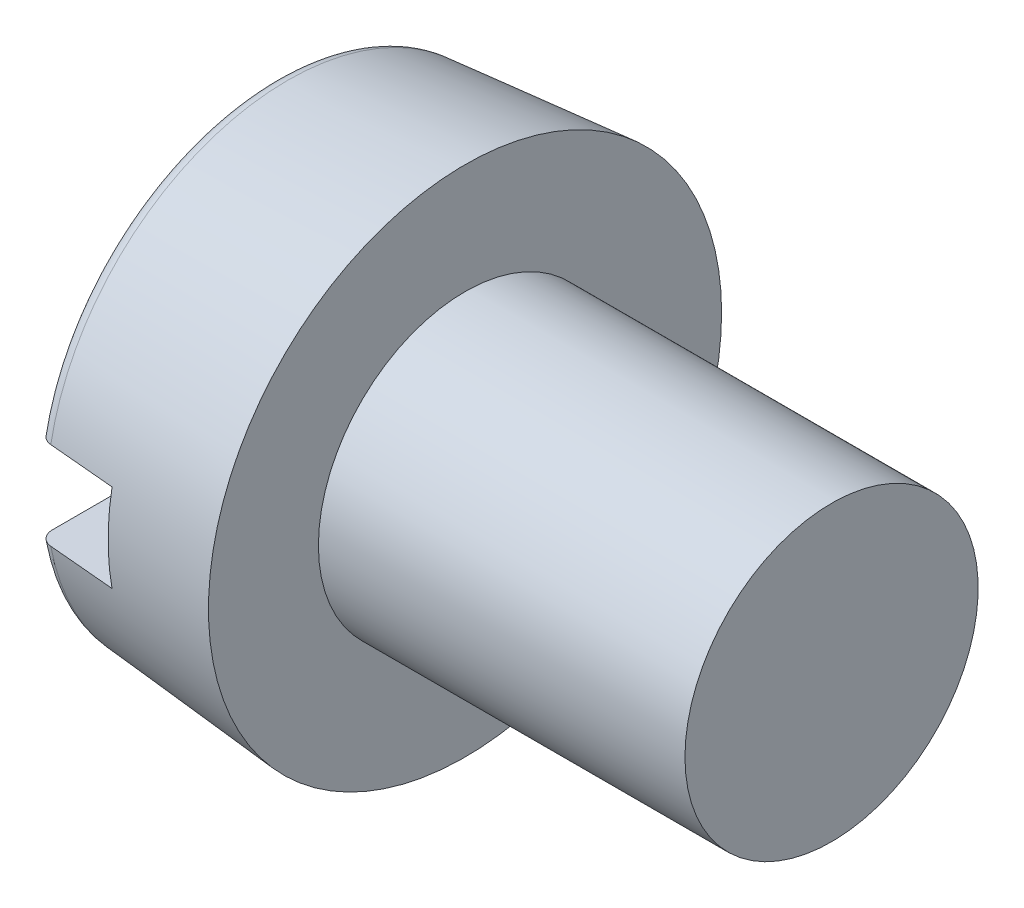
ISO-10303-21;
HEADER;
FILE_DESCRIPTION(('STEP AP214'),'2;1');
FILE_NAME('part.step','',(''),(''),'','','');
FILE_SCHEMA(('AUTOMOTIVE_DESIGN { 1 0 10303 214 1 1 1 1 }'));
ENDSEC;
DATA;
#1=APPLICATION_CONTEXT('core data for automotive mechanical design processes');
#2=APPLICATION_PROTOCOL_DEFINITION('international standard','automotive_design',2000,#1);
#3=PRODUCT_CONTEXT('',#1,'mechanical');
#4=PRODUCT('Part','Part','',(#3));
#5=PRODUCT_RELATED_PRODUCT_CATEGORY('part','',(#4));
#6=PRODUCT_DEFINITION_FORMATION('','',#4);
#7=PRODUCT_DEFINITION_CONTEXT('part definition',#1,'design');
#8=PRODUCT_DEFINITION('design','',#6,#7);
#9=PRODUCT_DEFINITION_SHAPE('','',#8);
#10=(LENGTH_UNIT() NAMED_UNIT(*) SI_UNIT(.MILLI.,.METRE.));
#11=(NAMED_UNIT(*) PLANE_ANGLE_UNIT() SI_UNIT($,.RADIAN.));
#12=(NAMED_UNIT(*) SI_UNIT($,.STERADIAN.) SOLID_ANGLE_UNIT());
#13=UNCERTAINTY_MEASURE_WITH_UNIT(LENGTH_MEASURE(1.E-05),#10,'distance_accuracy_value','');
#14=(GEOMETRIC_REPRESENTATION_CONTEXT(3) GLOBAL_UNCERTAINTY_ASSIGNED_CONTEXT((#13)) GLOBAL_UNIT_ASSIGNED_CONTEXT((#10,
#11,#12)) REPRESENTATION_CONTEXT('',''));
#15=CARTESIAN_POINT('',(0.,0.,0.));
#16=DIRECTION('',(0.,0.,1.));
#17=DIRECTION('',(1.,0.,0.));
#18=AXIS2_PLACEMENT_3D('',#15,#16,#17);
#19=CARTESIAN_POINT('',(1.1,0.6,-3.5));
#20=DIRECTION('',(-1.,0.,0.));
#21=DIRECTION('',(0.,0.,1.));
#22=AXIS2_PLACEMENT_3D('',#19,#20,#21);
#23=PLANE('',#22);
#24=DIRECTION('',(0.,0.,1.));
#25=VECTOR('',#24,1.);
#26=CARTESIAN_POINT('',(1.1,0.6,3.5));
#27=LINE('',#26,#25);
#28=CARTESIAN_POINT('',(1.10000000000466,0.6,3.31490439259874));
#29=VERTEX_POINT('',#28);
#30=CARTESIAN_POINT('',(1.10000000000405,0.6,-3.31490439259868));
#31=VERTEX_POINT('',#30);
#32=EDGE_CURVE('E79',#29,#31,#27,.F.);
#33=ORIENTED_EDGE('',*,*,#32,.T.);
#34=CARTESIAN_POINT('',(1.10000000000809,0.,0.));
#35=DIRECTION('',(1.,0.,0.));
#36=DIRECTION('',(0.,0.,-1.));
#37=AXIS2_PLACEMENT_3D('',#34,#35,#36);
#38=CIRCLE('',#37,3.36876700471737);
#39=CARTESIAN_POINT('',(1.10000000000468,-0.6,-3.31490439259874));
#40=VERTEX_POINT('',#39);
#41=EDGE_CURVE('E89',#31,#40,#38,.F.);
#42=ORIENTED_EDGE('',*,*,#41,.T.);
#43=DIRECTION('',(0.,0.,-1.));
#44=VECTOR('',#43,1.);
#45=CARTESIAN_POINT('',(1.1,-0.6,-3.5));
#46=LINE('',#45,#44);
#47=CARTESIAN_POINT('',(1.10000000000405,-0.600000000000001,3.31490439259868));
#48=VERTEX_POINT('',#47);
#49=EDGE_CURVE('E86',#40,#48,#46,.F.);
#50=ORIENTED_EDGE('',*,*,#49,.T.);
#51=CARTESIAN_POINT('',(1.10000000000809,0.,0.));
#52=DIRECTION('',(1.,0.,0.));
#53=DIRECTION('',(0.,0.,-1.));
#54=AXIS2_PLACEMENT_3D('',#51,#52,#53);
#55=CIRCLE('',#54,3.36876700471737);
#56=EDGE_CURVE('E19',#48,#29,#55,.F.);
#57=ORIENTED_EDGE('',*,*,#56,.T.);
#58=EDGE_LOOP('',(#33,#42,#50,#57));
#59=FACE_BOUND('',#58,.T.);
#60=ADVANCED_FACE('F16',(#59),#23,.T.);
#61=CARTESIAN_POINT('',(1.1,0.6,3.5));
#62=DIRECTION('',(0.,1.,0.));
#63=DIRECTION('',(0.,0.,1.));
#64=AXIS2_PLACEMENT_3D('',#61,#62,#63);
#65=PLANE('',#64);
#66=ORIENTED_EDGE('',*,*,#32,.F.);
#67=CARTESIAN_POINT('',(0.182568851454256,0.6,3.23330273645809));
#68=CARTESIAN_POINT('',(0.335473556850061,0.6,3.24690847681179));
#69=CARTESIAN_POINT('',(0.488378505260504,0.6,3.26051148500036));
#70=CARTESIAN_POINT('',(0.794188888109491,0.6,3.28771203704714));
#71=CARTESIAN_POINT('',(0.947094322548035,0.6,3.30130958090535));
#72=CARTESIAN_POINT('',(1.10000000000122,0.6,3.31490439259843));
#73=B_SPLINE_CURVE_WITH_KNOTS('',3,(#67,#68,#69,#70,#71,#72),.UNSPECIFIED.,.F.,.F.,(4,2,4),(0.,
0.460526530963861,0.921053061924176),.UNSPECIFIED.);
#74=CARTESIAN_POINT('',(0.182568851463089,0.6,3.23330273645694));
#75=VERTEX_POINT('',#74);
#76=EDGE_CURVE('E69',#75,#29,#73,.T.);
#77=ORIENTED_EDGE('',*,*,#76,.F.);
#78=CARTESIAN_POINT('',(0.,0.599999999999999,3.03043682761994));
#79=CARTESIAN_POINT('',(-8.92276711938872E-06,0.600000000000926,3.04205210805298));
#80=CARTESIAN_POINT('',(0.000973204864241999,0.600000000000543,3.05366618875901));
#81=CARTESIAN_POINT('',(0.0048583823746391,0.599999999999457,3.07656708233098));
#82=CARTESIAN_POINT('',(0.00776118005155454,0.599999999998755,3.08785393796157));
#83=CARTESIAN_POINT('',(0.0154293297762819,0.599999999999335,3.10978668687681));
#84=CARTESIAN_POINT('',(0.0201960317635953,0.600000000000619,3.12043210913728));
#85=CARTESIAN_POINT('',(0.0314639130665996,0.59999999999938,3.14075672068877));
#86=CARTESIAN_POINT('',(0.0379643576695787,0.599999999996858,3.15043631688841));
#87=CARTESIAN_POINT('',(0.0524560587306095,0.599999999997462,3.16845455019423));
#88=CARTESIAN_POINT('',(0.0604324501561322,0.600000000000534,3.17680513564901));
#89=CARTESIAN_POINT('',(0.0776955342490941,0.599999999999465,3.19201902933438));
#90=CARTESIAN_POINT('',(0.0869820289644172,0.599999999995325,3.19888256185703));
#91=CARTESIAN_POINT('',(0.106435856679454,0.599999999995523,3.21080710889614));
#92=CARTESIAN_POINT('',(0.116586055155842,0.599999999999723,3.2158960924536));
#93=CARTESIAN_POINT('',(0.137592975718863,0.600000000000275,3.22425888492082));
#94=CARTESIAN_POINT('',(0.148448535761883,0.59999999999664,3.22753559876399));
#95=CARTESIAN_POINT('',(0.167114441065982,0.599999999995137,3.23146563373131));
#96=CARTESIAN_POINT('',(0.174822526263816,0.599999999995827,3.23261780195108));
#97=CARTESIAN_POINT('',(0.18256885145479,0.6,3.23330273645209));
#98=B_SPLINE_CURVE_WITH_KNOTS('',3,(#78,#79,#80,#81,#82,#83,#84,#85,#86,#87,#88,#89,#90,#91,#92,
#93,#94,#95,#96,#97),.UNSPECIFIED.,.F.,.F.,(4,2,2,2,2,2,2,2,2,4),(0.,0.0348029281865724,
0.0696012873265984,0.104424896125296,0.139233771014052,0.173709468497491,0.208179962389296,
0.242079590894619,0.275924722159496,0.299249852575361),.UNSPECIFIED.);
#99=CARTESIAN_POINT('',(0.,0.6,3.03043682761994));
#100=VERTEX_POINT('',#99);
#101=EDGE_CURVE('E80',#100,#75,#98,.T.);
#102=ORIENTED_EDGE('',*,*,#101,.F.);
#103=DIRECTION('',(0.,0.,1.));
#104=VECTOR('',#103,1.);
#105=CARTESIAN_POINT('',(0.,0.6,0.));
#106=LINE('',#105,#104);
#107=CARTESIAN_POINT('',(0.,0.6,-3.03043682761994));
#108=VERTEX_POINT('',#107);
#109=EDGE_CURVE('E119',#108,#100,#106,.T.);
#110=ORIENTED_EDGE('',*,*,#109,.F.);
#111=CARTESIAN_POINT('',(0.182568851454788,0.599999999999999,-3.23330273645209));
#112=CARTESIAN_POINT('',(0.171472681594623,0.600000000000002,-3.23232565957753));
#113=CARTESIAN_POINT('',(0.160466490440903,0.600000000000001,-3.23038681875744));
#114=CARTESIAN_POINT('',(0.138948426592135,0.599999999999998,-3.22469378570043));
#115=CARTESIAN_POINT('',(0.128435940886201,0.599999999999996,-3.22094191371361));
#116=CARTESIAN_POINT('',(0.108187049490752,0.600000000000001,-3.21172671697903));
#117=CARTESIAN_POINT('',(0.0984508547008833,0.600000000000007,-3.20626292911875));
#118=CARTESIAN_POINT('',(0.0800245200002214,0.599999999999992,-3.193793084455));
#119=CARTESIAN_POINT('',(0.0713343007624212,0.59999999999997,-3.1867871447228));
#120=CARTESIAN_POINT('',(0.0551599248927894,0.600000000000032,-3.17137098416005));
#121=CARTESIAN_POINT('',(0.0476868506805745,0.600000000000117,-3.1629491407325));
#122=CARTESIAN_POINT('',(0.0342322998309484,0.599999999999882,-3.14498762109246));
#123=CARTESIAN_POINT('',(0.0282510437499762,0.599999999999561,-3.13544777989675));
#124=CARTESIAN_POINT('',(0.017840034395559,0.5999999999996,-3.11534500552784));
#125=CARTESIAN_POINT('',(0.0134390539697865,0.599999999999971,-3.10476717226775));
#126=CARTESIAN_POINT('',(0.00645122030947759,0.600000000000028,-3.08304101716856));
#127=CARTESIAN_POINT('',(0.00386248123053322,0.599999999999714,-3.07189330136284));
#128=CARTESIAN_POINT('',(0.000734376375379197,0.599999999999458,-3.05062255742231));
#129=CARTESIAN_POINT('',(-6.07384206114669E-06,0.599999999999478,-3.04052874119681));
#130=CARTESIAN_POINT('',(0.,0.599999999999999,-3.03043682761994));
#131=B_SPLINE_CURVE_WITH_KNOTS('',3,(#111,#112,#113,#114,#115,#116,#117,#118,#119,#120,#121,
#122,#123,#124,#125,#126,#127,#128,#129,#130),.UNSPECIFIED.,.F.,.F.,(4,2,2,2,2,2,2,2,2,4),(0.,
0.033369886991951,0.0666971810854079,0.100033498772122,0.133367286630274,0.166989405711503,
0.200616492680493,0.234828037616768,0.269003928393338,0.299257989197877),.UNSPECIFIED.);
#132=CARTESIAN_POINT('',(0.182568851462821,0.6,-3.23330273645994));
#133=VERTEX_POINT('',#132);
#134=EDGE_CURVE('E167',#133,#108,#131,.T.);
#135=ORIENTED_EDGE('',*,*,#134,.F.);
#136=CARTESIAN_POINT('',(1.10000000000126,0.6,-3.31490439259844));
#137=CARTESIAN_POINT('',(0.947094322548068,0.6,-3.30130958090535));
#138=CARTESIAN_POINT('',(0.794188888109517,0.6,-3.28771203704714));
#139=CARTESIAN_POINT('',(0.488378505260516,0.6,-3.26051148500036));
#140=CARTESIAN_POINT('',(0.335473556850066,0.6,-3.24690847681179));
#141=CARTESIAN_POINT('',(0.182568851454254,0.6,-3.23330273645809));
#142=B_SPLINE_CURVE_WITH_KNOTS('',3,(#136,#137,#138,#139,#140,#141),.UNSPECIFIED.,.F.,.F.,(4,2,
4),(0.,0.460526530960336,0.921053061924218),.UNSPECIFIED.);
#143=EDGE_CURVE('E92',#31,#133,#142,.T.);
#144=ORIENTED_EDGE('',*,*,#143,.F.);
#145=EDGE_LOOP('',(#66,#77,#102,#110,#135,#144));
#146=FACE_BOUND('',#145,.T.);
#147=ADVANCED_FACE('F90',(#146),#65,.F.);
#148=CARTESIAN_POINT('',(1.1,-0.6,-3.5));
#149=DIRECTION('',(0.,-1.,0.));
#150=DIRECTION('',(0.,0.,-1.));
#151=AXIS2_PLACEMENT_3D('',#148,#149,#150);
#152=PLANE('',#151);
#153=CARTESIAN_POINT('',(0.,-0.6,-3.03043682761993));
#154=CARTESIAN_POINT('',(-8.92276711936747E-06,-0.600000000000927,-3.04205210805298));
#155=CARTESIAN_POINT('',(0.000973204864241989,-0.600000000000543,-3.05366618875901));
#156=CARTESIAN_POINT('',(0.00485838237463901,-0.599999999999457,-3.07656708233098));
#157=CARTESIAN_POINT('',(0.00776118005155441,-0.599999999998754,-3.08785393796157));
#158=CARTESIAN_POINT('',(0.0154293297762817,-0.599999999999335,-3.10978668687681));
#159=CARTESIAN_POINT('',(0.020196031763595,-0.60000000000062,-3.12043210913728));
#160=CARTESIAN_POINT('',(0.0314639130665996,-0.59999999999938,-3.14075672068877));
#161=CARTESIAN_POINT('',(0.037964357669579,-0.599999999996857,-3.15043631688841));
#162=CARTESIAN_POINT('',(0.05245605873061,-0.599999999997461,-3.16845455019423));
#163=CARTESIAN_POINT('',(0.0604324501561325,-0.600000000000534,-3.17680513564901));
#164=CARTESIAN_POINT('',(0.0776955342490943,-0.599999999999465,-3.19201902933438));
#165=CARTESIAN_POINT('',(0.0869820289644173,-0.599999999995324,-3.19888256185703));
#166=CARTESIAN_POINT('',(0.106435856679454,-0.599999999995523,-3.21080710889614));
#167=CARTESIAN_POINT('',(0.116586055155843,-0.599999999999723,-3.2158960924536));
#168=CARTESIAN_POINT('',(0.137592975718864,-0.600000000000275,-3.22425888492082));
#169=CARTESIAN_POINT('',(0.148448535761883,-0.599999999996639,-3.22753559876399));
#170=CARTESIAN_POINT('',(0.167114441066279,-0.599999999995136,-3.23146563373137));
#171=CARTESIAN_POINT('',(0.174822526264416,-0.599999999995827,-3.23261780195117));
#172=CARTESIAN_POINT('',(0.182568851455695,-0.600000000000001,-3.23330273645217));
#173=B_SPLINE_CURVE_WITH_KNOTS('',3,(#153,#154,#155,#156,#157,#158,#159,#160,#161,#162,#163,
#164,#165,#166,#167,#168,#169,#170,#171,#172),.UNSPECIFIED.,.F.,.F.,(4,2,2,2,2,2,2,2,2,4),(0.,
0.0348029281865724,0.0696012873265988,0.104424896125296,0.139233771014053,0.173709468497492,
0.208179962389297,0.24207959089462,0.275924722159498,0.299249852576269),.UNSPECIFIED.);
#174=CARTESIAN_POINT('',(0.,-0.599999999999999,-3.03043682761993));
#175=VERTEX_POINT('',#174);
#176=CARTESIAN_POINT('',(0.182568851463541,-0.6,-3.23330273645698));
#177=VERTEX_POINT('',#176);
#178=EDGE_CURVE('E120',#175,#177,#173,.T.);
#179=ORIENTED_EDGE('',*,*,#178,.F.);
#180=DIRECTION('',(0.,0.,1.));
#181=VECTOR('',#180,1.);
#182=CARTESIAN_POINT('',(0.,-0.6,0.));
#183=LINE('',#182,#181);
#184=CARTESIAN_POINT('',(0.,-0.600000000000001,3.03043682761993));
#185=VERTEX_POINT('',#184);
#186=EDGE_CURVE('E191',#185,#175,#183,.F.);
#187=ORIENTED_EDGE('',*,*,#186,.F.);
#188=CARTESIAN_POINT('',(0.18256885145479,-0.600000000000002,3.23330273645209));
#189=CARTESIAN_POINT('',(0.171472681594625,-0.600000000000002,3.23232565957753));
#190=CARTESIAN_POINT('',(0.160466490440905,-0.600000000000001,3.23038681875744));
#191=CARTESIAN_POINT('',(0.138948426592136,-0.6,3.22469378570043));
#192=CARTESIAN_POINT('',(0.128435940886202,-0.6,3.22094191371361));
#193=CARTESIAN_POINT('',(0.108187049490754,-0.600000000000004,3.21172671697903));
#194=CARTESIAN_POINT('',(0.0984508547008849,-0.600000000000009,3.20626292911875));
#195=CARTESIAN_POINT('',(0.0800245200002227,-0.599999999999992,3.19379308445501));
#196=CARTESIAN_POINT('',(0.0713343007624224,-0.59999999999997,3.1867871447228));
#197=CARTESIAN_POINT('',(0.0551599248927908,-0.600000000000033,3.17137098416005));
#198=CARTESIAN_POINT('',(0.0476868506805764,-0.600000000000118,3.1629491407325));
#199=CARTESIAN_POINT('',(0.0342322998309501,-0.599999999999883,3.14498762109247));
#200=CARTESIAN_POINT('',(0.0282510437499773,-0.599999999999562,3.13544777989675));
#201=CARTESIAN_POINT('',(0.0178400343955597,-0.5999999999996,3.11534500552784));
#202=CARTESIAN_POINT('',(0.0134390539697875,-0.599999999999972,3.10476717226775));
#203=CARTESIAN_POINT('',(0.00645122030947848,-0.600000000000029,3.08304101716856));
#204=CARTESIAN_POINT('',(0.00386248123053382,-0.599999999999714,3.07189330136284));
#205=CARTESIAN_POINT('',(0.00073437637537923,-0.599999999999459,3.05062255742231));
#206=CARTESIAN_POINT('',(-6.07384206128968E-06,-0.599999999999479,3.04052874119681));
#207=CARTESIAN_POINT('',(0.,-0.600000000000001,3.03043682761993));
#208=B_SPLINE_CURVE_WITH_KNOTS('',3,(#188,#189,#190,#191,#192,#193,#194,#195,#196,#197,#198,
#199,#200,#201,#202,#203,#204,#205,#206,#207),.UNSPECIFIED.,.F.,.F.,(4,2,2,2,2,2,2,2,2,4),(0.,
0.0333698869919509,0.0666971810854078,0.100033498772122,0.133367286630274,0.166989405711502,
0.200616492680492,0.234828037616767,0.269003928393338,0.29925798919788),.UNSPECIFIED.);
#209=CARTESIAN_POINT('',(0.182568851462822,-0.600000000000001,3.23330273645994));
#210=VERTEX_POINT('',#209);
#211=EDGE_CURVE('E35',#210,#185,#208,.T.);
#212=ORIENTED_EDGE('',*,*,#211,.F.);
#213=CARTESIAN_POINT('',(1.10000000000122,-0.600000000000001,3.31490439259843));
#214=CARTESIAN_POINT('',(0.947094322548035,-0.600000000000001,3.30130958090535));
#215=CARTESIAN_POINT('',(0.794188888109491,-0.600000000000001,3.28771203704714));
#216=CARTESIAN_POINT('',(0.488378505260504,-0.600000000000001,3.26051148500036));
#217=CARTESIAN_POINT('',(0.33547355685006,-0.600000000000001,3.24690847681179));
#218=CARTESIAN_POINT('',(0.182568851454256,-0.600000000000001,3.23330273645809));
#219=B_SPLINE_CURVE_WITH_KNOTS('',3,(#213,#214,#215,#216,#217,#218),.UNSPECIFIED.,.F.,.F.,(4,2,
4),(0.,0.460526530960315,0.921053061924176),.UNSPECIFIED.);
#220=EDGE_CURVE('E138',#48,#210,#219,.T.);
#221=ORIENTED_EDGE('',*,*,#220,.F.);
#222=ORIENTED_EDGE('',*,*,#49,.F.);
#223=CARTESIAN_POINT('',(0.182568851455161,-0.6,-3.23330273645818));
#224=CARTESIAN_POINT('',(0.335473556850822,-0.6,-3.24690847681186));
#225=CARTESIAN_POINT('',(0.488378505261121,-0.6,-3.26051148500042));
#226=CARTESIAN_POINT('',(0.79418888810982,-0.6,-3.28771203704717));
#227=CARTESIAN_POINT('',(0.94709432254822,-0.6,-3.30130958090537));
#228=CARTESIAN_POINT('',(1.10000000000126,-0.6,-3.31490439259844));
#229=B_SPLINE_CURVE_WITH_KNOTS('',3,(#223,#224,#225,#226,#227,#228),.UNSPECIFIED.,.F.,.F.,(4,2,
4),(0.,0.460526530963427,0.921053061923307),.UNSPECIFIED.);
#230=EDGE_CURVE('E110',#177,#40,#229,.T.);
#231=ORIENTED_EDGE('',*,*,#230,.F.);
#232=EDGE_LOOP('',(#179,#187,#212,#221,#222,#231));
#233=FACE_BOUND('',#232,.T.);
#234=ADVANCED_FACE('F122',(#233),#152,.F.);
#235=CARTESIAN_POINT('',(0.,0.,0.));
#236=DIRECTION('',(-1.,0.,0.));
#237=DIRECTION('',(0.,0.,1.));
#238=AXIS2_PLACEMENT_3D('',#235,#236,#237);
#239=PLANE('',#238);
#240=ORIENTED_EDGE('',*,*,#109,.T.);
#241=CARTESIAN_POINT('',(0.,0.,0.));
#242=DIRECTION('',(1.,0.,0.));
#243=DIRECTION('',(0.,0.194221066118776,-0.980957785776578));
#244=AXIS2_PLACEMENT_3D('',#241,#242,#243);
#245=CIRCLE('',#244,3.08926324002911);
#246=EDGE_CURVE('E199',#108,#100,#245,.T.);
#247=ORIENTED_EDGE('',*,*,#246,.F.);
#248=EDGE_LOOP('',(#240,#247));
#249=FACE_BOUND('',#248,.T.);
#250=ADVANCED_FACE('F220',(#249),#239,.T.);
#251=CARTESIAN_POINT('',(0.,0.,0.));
#252=DIRECTION('',(-1.,0.,0.));
#253=DIRECTION('',(0.,0.,1.));
#254=AXIS2_PLACEMENT_3D('',#251,#252,#253);
#255=PLANE('',#254);
#256=ORIENTED_EDGE('',*,*,#186,.T.);
#257=CARTESIAN_POINT('',(0.,0.,0.));
#258=DIRECTION('',(1.,0.,0.));
#259=DIRECTION('',(0.,-0.194221066118777,0.980957785776578));
#260=AXIS2_PLACEMENT_3D('',#257,#258,#259);
#261=CIRCLE('',#260,3.08926324002911);
#262=EDGE_CURVE('E183',#185,#175,#261,.T.);
#263=ORIENTED_EDGE('',*,*,#262,.F.);
#264=EDGE_LOOP('',(#256,#263));
#265=FACE_BOUND('',#264,.T.);
#266=ADVANCED_FACE('F173',(#265),#255,.T.);
#267=CARTESIAN_POINT('',(0.2,0.,0.));
#268=DIRECTION('',(-1.,0.,0.));
#269=DIRECTION('',(0.,0.,1.));
#270=AXIS2_PLACEMENT_3D('',#267,#268,#269);
#271=TOROIDAL_SURFACE('',#270,3.08926324002911,0.2);
#272=ORIENTED_EDGE('',*,*,#101,.T.);
#273=CARTESIAN_POINT('',(0.182568851471387,0.,0.));
#274=DIRECTION('',(1.,0.,0.));
#275=DIRECTION('',(0.,0.,-1.));
#276=AXIS2_PLACEMENT_3D('',#273,#274,#275);
#277=CIRCLE('',#276,3.28850217965737);
#278=EDGE_CURVE('E75',#133,#75,#277,.T.);
#279=ORIENTED_EDGE('',*,*,#278,.F.);
#280=ORIENTED_EDGE('',*,*,#134,.T.);
#281=ORIENTED_EDGE('',*,*,#246,.T.);
#282=EDGE_LOOP('',(#272,#279,#280,#281));
#283=FACE_BOUND('',#282,.T.);
#284=ADVANCED_FACE('F168',(#283),#271,.T.);
#285=CARTESIAN_POINT('',(0.2,0.,0.));
#286=DIRECTION('',(-1.,0.,0.));
#287=DIRECTION('',(0.,0.,1.));
#288=AXIS2_PLACEMENT_3D('',#285,#286,#287);
#289=TOROIDAL_SURFACE('',#288,3.08926324002911,0.2);
#290=ORIENTED_EDGE('',*,*,#211,.T.);
#291=ORIENTED_EDGE('',*,*,#262,.T.);
#292=ORIENTED_EDGE('',*,*,#178,.T.);
#293=CARTESIAN_POINT('',(0.182568851471387,0.,0.));
#294=DIRECTION('',(1.,0.,0.));
#295=DIRECTION('',(0.,0.,-1.));
#296=AXIS2_PLACEMENT_3D('',#293,#294,#295);
#297=CIRCLE('',#296,3.28850217965737);
#298=EDGE_CURVE('E109',#210,#177,#297,.T.);
#299=ORIENTED_EDGE('',*,*,#298,.F.);
#300=EDGE_LOOP('',(#290,#291,#292,#299));
#301=FACE_BOUND('',#300,.T.);
#302=ADVANCED_FACE('F130',(#301),#289,.T.);
#303=CARTESIAN_POINT('',(2.59999999997262,0.,0.));
#304=DIRECTION('',(1.,0.,0.));
#305=DIRECTION('',(0.,0.,-1.));
#306=AXIS2_PLACEMENT_3D('',#303,#304,#305);
#307=CONICAL_SURFACE('',#306,3.5000000000025,0.0872664625992853);
#308=ORIENTED_EDGE('',*,*,#56,.F.);
#309=ORIENTED_EDGE('',*,*,#220,.T.);
#310=ORIENTED_EDGE('',*,*,#298,.T.);
#311=ORIENTED_EDGE('',*,*,#230,.T.);
#312=ORIENTED_EDGE('',*,*,#41,.F.);
#313=ORIENTED_EDGE('',*,*,#143,.T.);
#314=ORIENTED_EDGE('',*,*,#278,.T.);
#315=ORIENTED_EDGE('',*,*,#76,.T.);
#316=EDGE_LOOP('',(#308,#309,#310,#311,#312,#313,#314,#315));
#317=FACE_BOUND('',#316,.T.);
#318=CARTESIAN_POINT('',(2.59999999997262,0.,0.));
#319=DIRECTION('',(1.,0.,0.));
#320=DIRECTION('',(0.,0.,-1.));
#321=AXIS2_PLACEMENT_3D('',#318,#319,#320);
#322=CIRCLE('',#321,3.5000000000025);
#323=CARTESIAN_POINT('',(2.59999999997262,0.,-3.5000000000025));
#324=VERTEX_POINT('',#323);
#325=EDGE_CURVE('E105',#324,#324,#322,.F.);
#326=ORIENTED_EDGE('',*,*,#325,.T.);
#327=EDGE_LOOP('',(#326));
#328=FACE_BOUND('',#327,.T.);
#329=ADVANCED_FACE('F71',(#317,#328),#307,.T.);
#330=CARTESIAN_POINT('',(7.6,2.,0.));
#331=DIRECTION('',(1.,0.,0.));
#332=DIRECTION('',(0.,0.,-1.));
#333=AXIS2_PLACEMENT_3D('',#330,#331,#332);
#334=PLANE('',#333);
#335=CARTESIAN_POINT('',(7.6,0.,0.));
#336=DIRECTION('',(-1.,0.,0.));
#337=DIRECTION('',(0.,0.,1.));
#338=AXIS2_PLACEMENT_3D('',#335,#336,#337);
#339=CIRCLE('',#338,2.);
#340=CARTESIAN_POINT('',(7.6,0.,2.));
#341=VERTEX_POINT('',#340);
#342=EDGE_CURVE('E26',#341,#341,#339,.T.);
#343=ORIENTED_EDGE('',*,*,#342,.F.);
#344=EDGE_LOOP('',(#343));
#345=FACE_BOUND('',#344,.T.);
#346=ADVANCED_FACE('F129',(#345),#334,.T.);
#347=CARTESIAN_POINT('',(2.6,2.,0.));
#348=DIRECTION('',(-1.,0.,0.));
#349=DIRECTION('',(0.,0.,1.));
#350=AXIS2_PLACEMENT_3D('',#347,#348,#349);
#351=PLANE('',#350);
#352=CARTESIAN_POINT('',(2.6,0.,0.));
#353=DIRECTION('',(-1.,0.,0.));
#354=DIRECTION('',(0.,0.,1.));
#355=AXIS2_PLACEMENT_3D('',#352,#353,#354);
#356=CIRCLE('',#355,2.);
#357=CARTESIAN_POINT('',(2.6,0.,2.));
#358=VERTEX_POINT('',#357);
#359=EDGE_CURVE('E11',#358,#358,#356,.F.);
#360=ORIENTED_EDGE('',*,*,#359,.F.);
#361=EDGE_LOOP('',(#360));
#362=FACE_BOUND('',#361,.T.);
#363=ORIENTED_EDGE('',*,*,#325,.F.);
#364=EDGE_LOOP('',(#363));
#365=FACE_BOUND('',#364,.T.);
#366=ADVANCED_FACE('F236',(#362,#365),#351,.F.);
#367=CARTESIAN_POINT('',(-25.4,0.,0.));
#368=DIRECTION('',(-1.,0.,0.));
#369=DIRECTION('',(0.,0.,1.));
#370=AXIS2_PLACEMENT_3D('',#367,#368,#369);
#371=CYLINDRICAL_SURFACE('',#370,2.);
#372=ORIENTED_EDGE('',*,*,#359,.T.);
#373=EDGE_LOOP('',(#372));
#374=FACE_BOUND('',#373,.T.);
#375=ORIENTED_EDGE('',*,*,#342,.T.);
#376=EDGE_LOOP('',(#375));
#377=FACE_BOUND('',#376,.T.);
#378=ADVANCED_FACE('F234',(#374,#377),#371,.T.);
#379=CLOSED_SHELL('',(#60,#147,#234,#250,#266,#284,#302,#329,#346,#366,#378));
#380=MANIFOLD_SOLID_BREP('B1',#379);
#381=ADVANCED_BREP_SHAPE_REPRESENTATION('',(#18,#380),#14);
#382=SHAPE_DEFINITION_REPRESENTATION(#9,#381);
ENDSEC;
END-ISO-10303-21;
